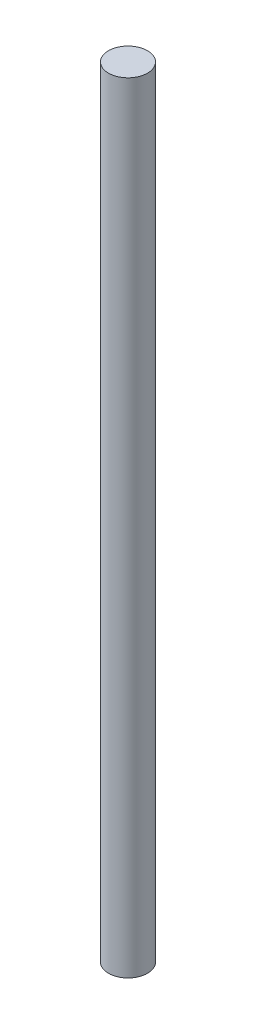
ISO-10303-21;
HEADER;
FILE_DESCRIPTION(('STEP AP214'),'2;1');
FILE_NAME('part.step','',(''),(''),'','','');
FILE_SCHEMA(('AUTOMOTIVE_DESIGN { 1 0 10303 214 1 1 1 1 }'));
ENDSEC;
DATA;
#1=APPLICATION_CONTEXT('core data for automotive mechanical design processes');
#2=APPLICATION_PROTOCOL_DEFINITION('international standard','automotive_design',2000,#1);
#3=PRODUCT_CONTEXT('',#1,'mechanical');
#4=PRODUCT('Part','Part','',(#3));
#5=PRODUCT_RELATED_PRODUCT_CATEGORY('part','',(#4));
#6=PRODUCT_DEFINITION_FORMATION('','',#4);
#7=PRODUCT_DEFINITION_CONTEXT('part definition',#1,'design');
#8=PRODUCT_DEFINITION('design','',#6,#7);
#9=PRODUCT_DEFINITION_SHAPE('','',#8);
#10=(LENGTH_UNIT() NAMED_UNIT(*) SI_UNIT(.MILLI.,.METRE.));
#11=(NAMED_UNIT(*) PLANE_ANGLE_UNIT() SI_UNIT($,.RADIAN.));
#12=(NAMED_UNIT(*) SI_UNIT($,.STERADIAN.) SOLID_ANGLE_UNIT());
#13=UNCERTAINTY_MEASURE_WITH_UNIT(LENGTH_MEASURE(1.E-05),#10,'distance_accuracy_value','');
#14=(GEOMETRIC_REPRESENTATION_CONTEXT(3) GLOBAL_UNCERTAINTY_ASSIGNED_CONTEXT((#13)) GLOBAL_UNIT_ASSIGNED_CONTEXT((#10,
#11,#12)) REPRESENTATION_CONTEXT('',''));
#15=CARTESIAN_POINT('',(0.,0.,0.));
#16=DIRECTION('',(0.,0.,1.));
#17=DIRECTION('',(1.,0.,0.));
#18=AXIS2_PLACEMENT_3D('',#15,#16,#17);
#19=CARTESIAN_POINT('',(0.,60.,0.));
#20=DIRECTION('',(0.,-1.,0.));
#21=DIRECTION('',(0.,0.,-1.));
#22=AXIS2_PLACEMENT_3D('',#19,#20,#21);
#23=CYLINDRICAL_SURFACE('',#22,1.5);
#24=CARTESIAN_POINT('',(0.,60.,0.));
#25=DIRECTION('',(0.,1.,0.));
#26=DIRECTION('',(0.,0.,1.));
#27=AXIS2_PLACEMENT_3D('',#24,#25,#26);
#28=CIRCLE('',#27,1.5);
#29=CARTESIAN_POINT('',(0.,60.,1.5));
#30=VERTEX_POINT('',#29);
#31=EDGE_CURVE('E10',#30,#30,#28,.T.);
#32=ORIENTED_EDGE('',*,*,#31,.F.);
#33=EDGE_LOOP('',(#32));
#34=FACE_BOUND('',#33,.T.);
#35=CARTESIAN_POINT('',(0.,0.,0.));
#36=DIRECTION('',(0.,1.,0.));
#37=DIRECTION('',(0.,0.,1.));
#38=AXIS2_PLACEMENT_3D('',#35,#36,#37);
#39=CIRCLE('',#38,1.5);
#40=CARTESIAN_POINT('',(0.,0.,1.5));
#41=VERTEX_POINT('',#40);
#42=EDGE_CURVE('E33',#41,#41,#39,.T.);
#43=ORIENTED_EDGE('',*,*,#42,.T.);
#44=EDGE_LOOP('',(#43));
#45=FACE_BOUND('',#44,.T.);
#46=ADVANCED_FACE('F30',(#34,#45),#23,.T.);
#47=CARTESIAN_POINT('',(0.,60.,0.));
#48=DIRECTION('',(0.,1.,0.));
#49=DIRECTION('',(0.,0.,1.));
#50=AXIS2_PLACEMENT_3D('',#47,#48,#49);
#51=PLANE('',#50);
#52=ORIENTED_EDGE('',*,*,#31,.T.);
#53=EDGE_LOOP('',(#52));
#54=FACE_BOUND('',#53,.T.);
#55=ADVANCED_FACE('F45',(#54),#51,.T.);
#56=CARTESIAN_POINT('',(0.,0.,0.));
#57=DIRECTION('',(0.,1.,0.));
#58=DIRECTION('',(0.,0.,1.));
#59=AXIS2_PLACEMENT_3D('',#56,#57,#58);
#60=PLANE('',#59);
#61=ORIENTED_EDGE('',*,*,#42,.F.);
#62=EDGE_LOOP('',(#61));
#63=FACE_BOUND('',#62,.T.);
#64=ADVANCED_FACE('F43',(#63),#60,.F.);
#65=CLOSED_SHELL('',(#46,#55,#64));
#66=MANIFOLD_SOLID_BREP('B2',#65);
#67=ADVANCED_BREP_SHAPE_REPRESENTATION('',(#18,#66),#14);
#68=SHAPE_DEFINITION_REPRESENTATION(#9,#67);
ENDSEC;
END-ISO-10303-21;
